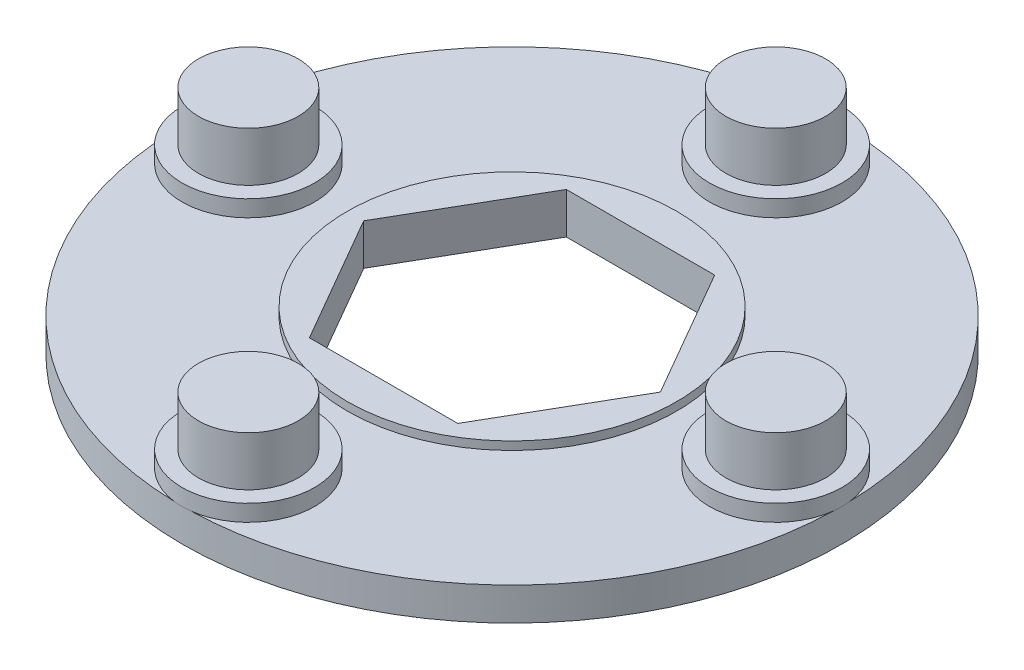
ISO-10303-21;
HEADER;
FILE_DESCRIPTION(('STEP AP214'),'2;1');
FILE_NAME('part.step','',(''),(''),'','','');
FILE_SCHEMA(('AUTOMOTIVE_DESIGN { 1 0 10303 214 1 1 1 1 }'));
ENDSEC;
DATA;
#1=APPLICATION_CONTEXT('core data for automotive mechanical design processes');
#2=APPLICATION_PROTOCOL_DEFINITION('international standard','automotive_design',2000,#1);
#3=PRODUCT_CONTEXT('',#1,'mechanical');
#4=PRODUCT('Part','Part','',(#3));
#5=PRODUCT_RELATED_PRODUCT_CATEGORY('part','',(#4));
#6=PRODUCT_DEFINITION_FORMATION('','',#4);
#7=PRODUCT_DEFINITION_CONTEXT('part definition',#1,'design');
#8=PRODUCT_DEFINITION('design','',#6,#7);
#9=PRODUCT_DEFINITION_SHAPE('','',#8);
#10=(LENGTH_UNIT() NAMED_UNIT(*) SI_UNIT(.MILLI.,.METRE.));
#11=(NAMED_UNIT(*) PLANE_ANGLE_UNIT() SI_UNIT($,.RADIAN.));
#12=(NAMED_UNIT(*) SI_UNIT($,.STERADIAN.) SOLID_ANGLE_UNIT());
#13=UNCERTAINTY_MEASURE_WITH_UNIT(LENGTH_MEASURE(1.E-05),#10,'distance_accuracy_value','');
#14=(GEOMETRIC_REPRESENTATION_CONTEXT(3) GLOBAL_UNCERTAINTY_ASSIGNED_CONTEXT((#13)) GLOBAL_UNIT_ASSIGNED_CONTEXT((#10,
#11,#12)) REPRESENTATION_CONTEXT('',''));
#15=CARTESIAN_POINT('',(0.,0.,0.));
#16=DIRECTION('',(0.,0.,1.));
#17=DIRECTION('',(1.,0.,0.));
#18=AXIS2_PLACEMENT_3D('',#15,#16,#17);
#19=CARTESIAN_POINT('',(0.,2.,0.));
#20=DIRECTION('',(0.,-1.,0.));
#21=DIRECTION('',(0.,0.,-1.));
#22=AXIS2_PLACEMENT_3D('',#19,#20,#21);
#23=CYLINDRICAL_SURFACE('',#22,20.);
#24=CARTESIAN_POINT('',(0.,2.,0.));
#25=DIRECTION('',(0.,1.,0.));
#26=DIRECTION('',(0.,0.,1.));
#27=AXIS2_PLACEMENT_3D('',#24,#25,#26);
#28=CIRCLE('',#27,20.);
#29=CARTESIAN_POINT('',(0.500741393313961,2.,-19.99373046875));
#30=VERTEX_POINT('',#29);
#31=CARTESIAN_POINT('',(-0.500741393313963,2.,-19.99373046875));
#32=VERTEX_POINT('',#31);
#33=EDGE_CURVE('E11',#30,#32,#28,.T.);
#34=ORIENTED_EDGE('',*,*,#33,.F.);
#35=CARTESIAN_POINT('',(19.99373046875,2.,-0.500741393313964));
#36=VERTEX_POINT('',#35);
#37=EDGE_CURVE('E131',#36,#30,#28,.T.);
#38=ORIENTED_EDGE('',*,*,#37,.F.);
#39=CARTESIAN_POINT('',(0.,2.,0.));
#40=DIRECTION('',(0.,1.,0.));
#41=DIRECTION('',(0.,0.,1.));
#42=AXIS2_PLACEMENT_3D('',#39,#40,#41);
#43=CIRCLE('',#42,20.);
#44=CARTESIAN_POINT('',(19.99373046875,2.,0.50074139331396));
#45=VERTEX_POINT('',#44);
#46=EDGE_CURVE('E151',#45,#36,#43,.T.);
#47=ORIENTED_EDGE('',*,*,#46,.F.);
#48=CARTESIAN_POINT('',(0.500741393313965,2.,19.99373046875));
#49=VERTEX_POINT('',#48);
#50=EDGE_CURVE('E132',#49,#45,#28,.T.);
#51=ORIENTED_EDGE('',*,*,#50,.F.);
#52=CARTESIAN_POINT('',(0.,2.,0.));
#53=DIRECTION('',(0.,1.,0.));
#54=DIRECTION('',(0.,0.,1.));
#55=AXIS2_PLACEMENT_3D('',#52,#53,#54);
#56=CIRCLE('',#55,20.);
#57=CARTESIAN_POINT('',(-0.500741393313959,2.,19.99373046875));
#58=VERTEX_POINT('',#57);
#59=EDGE_CURVE('E155',#58,#49,#56,.T.);
#60=ORIENTED_EDGE('',*,*,#59,.F.);
#61=CARTESIAN_POINT('',(-19.99373046875,2.,0.500741393313966));
#62=VERTEX_POINT('',#61);
#63=EDGE_CURVE('E42',#62,#58,#28,.T.);
#64=ORIENTED_EDGE('',*,*,#63,.F.);
#65=CARTESIAN_POINT('',(0.,2.,0.));
#66=DIRECTION('',(0.,1.,0.));
#67=DIRECTION('',(0.,0.,1.));
#68=AXIS2_PLACEMENT_3D('',#65,#66,#67);
#69=CIRCLE('',#68,20.);
#70=CARTESIAN_POINT('',(-19.99373046875,2.,-0.500741393313958));
#71=VERTEX_POINT('',#70);
#72=EDGE_CURVE('E119',#71,#62,#69,.T.);
#73=ORIENTED_EDGE('',*,*,#72,.F.);
#74=EDGE_CURVE('E40',#32,#71,#28,.T.);
#75=ORIENTED_EDGE('',*,*,#74,.F.);
#76=EDGE_LOOP('',(#34,#38,#47,#51,#60,#64,#73,#75));
#77=FACE_BOUND('',#76,.T.);
#78=CARTESIAN_POINT('',(0.,0.,0.));
#79=DIRECTION('',(0.,1.,0.));
#80=DIRECTION('',(0.,0.,1.));
#81=AXIS2_PLACEMENT_3D('',#78,#79,#80);
#82=CIRCLE('',#81,20.);
#83=CARTESIAN_POINT('',(0.,0.,20.));
#84=VERTEX_POINT('',#83);
#85=EDGE_CURVE('E135',#84,#84,#82,.T.);
#86=ORIENTED_EDGE('',*,*,#85,.T.);
#87=EDGE_LOOP('',(#86));
#88=FACE_BOUND('',#87,.T.);
#89=ADVANCED_FACE('F32',(#77,#88),#23,.T.);
#90=CARTESIAN_POINT('',(0.,2.,0.));
#91=DIRECTION('',(0.,1.,0.));
#92=DIRECTION('',(0.,0.,1.));
#93=AXIS2_PLACEMENT_3D('',#90,#91,#92);
#94=PLANE('',#93);
#95=CARTESIAN_POINT('',(0.,2.,0.));
#96=DIRECTION('',(0.,1.,0.));
#97=DIRECTION('',(0.,0.,1.));
#98=AXIS2_PLACEMENT_3D('',#95,#96,#97);
#99=CIRCLE('',#98,10.);
#100=CARTESIAN_POINT('',(0.,2.,10.));
#101=VERTEX_POINT('',#100);
#102=EDGE_CURVE('E226',#101,#101,#99,.T.);
#103=ORIENTED_EDGE('',*,*,#102,.F.);
#104=EDGE_LOOP('',(#103));
#105=FACE_BOUND('',#104,.T.);
#106=ORIENTED_EDGE('',*,*,#74,.T.);
#107=CARTESIAN_POINT('',(-16.,2.,0.));
#108=DIRECTION('',(0.,1.,0.));
#109=DIRECTION('',(0.,0.,1.));
#110=AXIS2_PLACEMENT_3D('',#107,#108,#109);
#111=CIRCLE('',#110,4.025);
#112=EDGE_CURVE('E110',#62,#71,#111,.T.);
#113=ORIENTED_EDGE('',*,*,#112,.F.);
#114=ORIENTED_EDGE('',*,*,#63,.T.);
#115=CARTESIAN_POINT('',(0.,2.,16.));
#116=DIRECTION('',(0.,1.,0.));
#117=DIRECTION('',(0.,0.,1.));
#118=AXIS2_PLACEMENT_3D('',#115,#116,#117);
#119=CIRCLE('',#118,4.025);
#120=EDGE_CURVE('E166',#49,#58,#119,.T.);
#121=ORIENTED_EDGE('',*,*,#120,.F.);
#122=ORIENTED_EDGE('',*,*,#50,.T.);
#123=CARTESIAN_POINT('',(16.,2.,0.));
#124=DIRECTION('',(0.,1.,0.));
#125=DIRECTION('',(0.,0.,1.));
#126=AXIS2_PLACEMENT_3D('',#123,#124,#125);
#127=CIRCLE('',#126,4.025);
#128=EDGE_CURVE('E154',#36,#45,#127,.T.);
#129=ORIENTED_EDGE('',*,*,#128,.F.);
#130=ORIENTED_EDGE('',*,*,#37,.T.);
#131=CARTESIAN_POINT('',(0.,2.,-16.));
#132=DIRECTION('',(0.,1.,0.));
#133=DIRECTION('',(0.,0.,1.));
#134=AXIS2_PLACEMENT_3D('',#131,#132,#133);
#135=CIRCLE('',#134,4.025);
#136=EDGE_CURVE('E130',#32,#30,#135,.T.);
#137=ORIENTED_EDGE('',*,*,#136,.F.);
#138=EDGE_LOOP('',(#106,#113,#114,#121,#122,#129,#130,#137));
#139=FACE_BOUND('',#138,.T.);
#140=ADVANCED_FACE('F128',(#105,#139),#94,.T.);
#141=CARTESIAN_POINT('',(0.,0.,0.));
#142=DIRECTION('',(0.,1.,0.));
#143=DIRECTION('',(0.,0.,1.));
#144=AXIS2_PLACEMENT_3D('',#141,#142,#143);
#145=PLANE('',#144);
#146=DIRECTION('',(0.5,0.,0.866025403784439));
#147=VECTOR('',#146,1.);
#148=CARTESIAN_POINT('',(-6.75,0.,3.89711431702997));
#149=LINE('',#148,#147);
#150=CARTESIAN_POINT('',(-8.99999999999999,0.,0.));
#151=VERTEX_POINT('',#150);
#152=CARTESIAN_POINT('',(-4.5,0.,7.79422863405995));
#153=VERTEX_POINT('',#152);
#154=EDGE_CURVE('E220',#151,#153,#149,.T.);
#155=ORIENTED_EDGE('',*,*,#154,.T.);
#156=DIRECTION('',(1.,0.,0.));
#157=VECTOR('',#156,1.);
#158=CARTESIAN_POINT('',(0.,0.,7.79422863405995));
#159=LINE('',#158,#157);
#160=CARTESIAN_POINT('',(4.5,0.,7.79422863405995));
#161=VERTEX_POINT('',#160);
#162=EDGE_CURVE('E223',#153,#161,#159,.T.);
#163=ORIENTED_EDGE('',*,*,#162,.T.);
#164=DIRECTION('',(0.5,0.,-0.866025403784439));
#165=VECTOR('',#164,1.);
#166=CARTESIAN_POINT('',(6.75,0.,3.89711431702997));
#167=LINE('',#166,#165);
#168=CARTESIAN_POINT('',(9.,0.,0.));
#169=VERTEX_POINT('',#168);
#170=EDGE_CURVE('E198',#161,#169,#167,.T.);
#171=ORIENTED_EDGE('',*,*,#170,.T.);
#172=DIRECTION('',(-0.5,0.,-0.866025403784439));
#173=VECTOR('',#172,1.);
#174=CARTESIAN_POINT('',(6.75,0.,-3.89711431702997));
#175=LINE('',#174,#173);
#176=CARTESIAN_POINT('',(4.5,0.,-7.79422863405995));
#177=VERTEX_POINT('',#176);
#178=EDGE_CURVE('E211',#169,#177,#175,.T.);
#179=ORIENTED_EDGE('',*,*,#178,.T.);
#180=DIRECTION('',(-1.,0.,0.));
#181=VECTOR('',#180,1.);
#182=CARTESIAN_POINT('',(0.,0.,-7.79422863405995));
#183=LINE('',#182,#181);
#184=CARTESIAN_POINT('',(-4.5,0.,-7.79422863405995));
#185=VERTEX_POINT('',#184);
#186=EDGE_CURVE('E214',#177,#185,#183,.T.);
#187=ORIENTED_EDGE('',*,*,#186,.T.);
#188=DIRECTION('',(-0.5,0.,0.866025403784439));
#189=VECTOR('',#188,1.);
#190=CARTESIAN_POINT('',(-6.75,0.,-3.89711431702997));
#191=LINE('',#190,#189);
#192=EDGE_CURVE('E217',#185,#151,#191,.T.);
#193=ORIENTED_EDGE('',*,*,#192,.T.);
#194=EDGE_LOOP('',(#155,#163,#171,#179,#187,#193));
#195=FACE_BOUND('',#194,.T.);
#196=ORIENTED_EDGE('',*,*,#85,.F.);
#197=EDGE_LOOP('',(#196));
#198=FACE_BOUND('',#197,.T.);
#199=ADVANCED_FACE('F262',(#195,#198),#145,.F.);
#200=CARTESIAN_POINT('',(0.,2.5,0.));
#201=DIRECTION('',(0.,-1.,0.));
#202=DIRECTION('',(0.,0.,-1.));
#203=AXIS2_PLACEMENT_3D('',#200,#201,#202);
#204=CYLINDRICAL_SURFACE('',#203,10.);
#205=CARTESIAN_POINT('',(0.,2.5,0.));
#206=DIRECTION('',(0.,1.,0.));
#207=DIRECTION('',(0.,0.,1.));
#208=AXIS2_PLACEMENT_3D('',#205,#206,#207);
#209=CIRCLE('',#208,10.);
#210=CARTESIAN_POINT('',(0.,2.5,10.));
#211=VERTEX_POINT('',#210);
#212=EDGE_CURVE('E227',#211,#211,#209,.T.);
#213=ORIENTED_EDGE('',*,*,#212,.F.);
#214=EDGE_LOOP('',(#213));
#215=FACE_BOUND('',#214,.T.);
#216=ORIENTED_EDGE('',*,*,#102,.T.);
#217=EDGE_LOOP('',(#216));
#218=FACE_BOUND('',#217,.T.);
#219=ADVANCED_FACE('F268',(#215,#218),#204,.T.);
#220=CARTESIAN_POINT('',(0.,2.5,0.));
#221=DIRECTION('',(0.,1.,0.));
#222=DIRECTION('',(0.,0.,1.));
#223=AXIS2_PLACEMENT_3D('',#220,#221,#222);
#224=PLANE('',#223);
#225=DIRECTION('',(1.,0.,0.));
#226=VECTOR('',#225,1.);
#227=CARTESIAN_POINT('',(-4.5,2.5,7.79422863405995));
#228=LINE('',#227,#226);
#229=CARTESIAN_POINT('',(-4.5,2.5,7.79422863405995));
#230=VERTEX_POINT('',#229);
#231=CARTESIAN_POINT('',(4.5,2.5,7.79422863405995));
#232=VERTEX_POINT('',#231);
#233=EDGE_CURVE('E147',#230,#232,#228,.T.);
#234=ORIENTED_EDGE('',*,*,#233,.F.);
#235=DIRECTION('',(0.5,0.,0.866025403784439));
#236=VECTOR('',#235,1.);
#237=CARTESIAN_POINT('',(-8.99999999999999,2.5,0.));
#238=LINE('',#237,#236);
#239=CARTESIAN_POINT('',(-8.99999999999999,2.5,0.));
#240=VERTEX_POINT('',#239);
#241=EDGE_CURVE('E192',#240,#230,#238,.T.);
#242=ORIENTED_EDGE('',*,*,#241,.F.);
#243=DIRECTION('',(-0.5,0.,0.866025403784439));
#244=VECTOR('',#243,1.);
#245=CARTESIAN_POINT('',(-4.5,2.5,-7.79422863405995));
#246=LINE('',#245,#244);
#247=CARTESIAN_POINT('',(-4.5,2.5,-7.79422863405995));
#248=VERTEX_POINT('',#247);
#249=EDGE_CURVE('E189',#248,#240,#246,.T.);
#250=ORIENTED_EDGE('',*,*,#249,.F.);
#251=DIRECTION('',(-1.,0.,0.));
#252=VECTOR('',#251,1.);
#253=CARTESIAN_POINT('',(4.5,2.5,-7.79422863405995));
#254=LINE('',#253,#252);
#255=CARTESIAN_POINT('',(4.5,2.5,-7.79422863405995));
#256=VERTEX_POINT('',#255);
#257=EDGE_CURVE('E186',#256,#248,#254,.T.);
#258=ORIENTED_EDGE('',*,*,#257,.F.);
#259=DIRECTION('',(-0.5,0.,-0.866025403784439));
#260=VECTOR('',#259,1.);
#261=CARTESIAN_POINT('',(9.,2.5,0.));
#262=LINE('',#261,#260);
#263=CARTESIAN_POINT('',(9.,2.5,0.));
#264=VERTEX_POINT('',#263);
#265=EDGE_CURVE('E183',#264,#256,#262,.T.);
#266=ORIENTED_EDGE('',*,*,#265,.F.);
#267=DIRECTION('',(0.5,0.,-0.866025403784439));
#268=VECTOR('',#267,1.);
#269=CARTESIAN_POINT('',(4.5,2.5,7.79422863405995));
#270=LINE('',#269,#268);
#271=EDGE_CURVE('E180',#232,#264,#270,.T.);
#272=ORIENTED_EDGE('',*,*,#271,.F.);
#273=EDGE_LOOP('',(#234,#242,#250,#258,#266,#272));
#274=FACE_BOUND('',#273,.T.);
#275=ORIENTED_EDGE('',*,*,#212,.T.);
#276=EDGE_LOOP('',(#275));
#277=FACE_BOUND('',#276,.T.);
#278=ADVANCED_FACE('F323',(#274,#277),#224,.T.);
#279=CARTESIAN_POINT('',(-4.5,-3.5,7.79422863405995));
#280=DIRECTION('',(0.,0.,1.));
#281=DIRECTION('',(1.,0.,0.));
#282=AXIS2_PLACEMENT_3D('',#279,#280,#281);
#283=PLANE('',#282);
#284=DIRECTION('',(0.,1.,0.));
#285=VECTOR('',#284,1.);
#286=CARTESIAN_POINT('',(-4.5,-3.5,7.79422863405995));
#287=LINE('',#286,#285);
#288=EDGE_CURVE('E196',#153,#230,#287,.T.);
#289=ORIENTED_EDGE('',*,*,#288,.T.);
#290=ORIENTED_EDGE('',*,*,#233,.T.);
#291=DIRECTION('',(0.,1.,0.));
#292=VECTOR('',#291,1.);
#293=CARTESIAN_POINT('',(4.5,-3.5,7.79422863405995));
#294=LINE('',#293,#292);
#295=EDGE_CURVE('E195',#161,#232,#294,.T.);
#296=ORIENTED_EDGE('',*,*,#295,.F.);
#297=ORIENTED_EDGE('',*,*,#162,.F.);
#298=EDGE_LOOP('',(#289,#290,#296,#297));
#299=FACE_BOUND('',#298,.T.);
#300=ADVANCED_FACE('F305',(#299),#283,.F.);
#301=CARTESIAN_POINT('',(-8.99999999999999,-3.5,0.));
#302=DIRECTION('',(-0.866025403784439,0.,0.5));
#303=DIRECTION('',(0.5,0.,0.866025403784439));
#304=AXIS2_PLACEMENT_3D('',#301,#302,#303);
#305=PLANE('',#304);
#306=DIRECTION('',(0.,1.,0.));
#307=VECTOR('',#306,1.);
#308=CARTESIAN_POINT('',(-8.99999999999999,-3.5,0.));
#309=LINE('',#308,#307);
#310=EDGE_CURVE('E199',#151,#240,#309,.T.);
#311=ORIENTED_EDGE('',*,*,#310,.T.);
#312=ORIENTED_EDGE('',*,*,#241,.T.);
#313=ORIENTED_EDGE('',*,*,#288,.F.);
#314=ORIENTED_EDGE('',*,*,#154,.F.);
#315=EDGE_LOOP('',(#311,#312,#313,#314));
#316=FACE_BOUND('',#315,.T.);
#317=ADVANCED_FACE('F301',(#316),#305,.F.);
#318=CARTESIAN_POINT('',(-4.5,-3.5,-7.79422863405995));
#319=DIRECTION('',(-0.866025403784439,0.,-0.5));
#320=DIRECTION('',(-0.5,0.,0.866025403784439));
#321=AXIS2_PLACEMENT_3D('',#318,#319,#320);
#322=PLANE('',#321);
#323=DIRECTION('',(0.,1.,0.));
#324=VECTOR('',#323,1.);
#325=CARTESIAN_POINT('',(-4.5,-3.5,-7.79422863405995));
#326=LINE('',#325,#324);
#327=EDGE_CURVE('E201',#185,#248,#326,.T.);
#328=ORIENTED_EDGE('',*,*,#327,.T.);
#329=ORIENTED_EDGE('',*,*,#249,.T.);
#330=ORIENTED_EDGE('',*,*,#310,.F.);
#331=ORIENTED_EDGE('',*,*,#192,.F.);
#332=EDGE_LOOP('',(#328,#329,#330,#331));
#333=FACE_BOUND('',#332,.T.);
#334=ADVANCED_FACE('F304',(#333),#322,.F.);
#335=CARTESIAN_POINT('',(4.5,-3.5,-7.79422863405995));
#336=DIRECTION('',(0.,0.,-1.));
#337=DIRECTION('',(-1.,0.,0.));
#338=AXIS2_PLACEMENT_3D('',#335,#336,#337);
#339=PLANE('',#338);
#340=DIRECTION('',(0.,1.,0.));
#341=VECTOR('',#340,1.);
#342=CARTESIAN_POINT('',(4.5,-3.5,-7.79422863405995));
#343=LINE('',#342,#341);
#344=EDGE_CURVE('E203',#177,#256,#343,.T.);
#345=ORIENTED_EDGE('',*,*,#344,.T.);
#346=ORIENTED_EDGE('',*,*,#257,.T.);
#347=ORIENTED_EDGE('',*,*,#327,.F.);
#348=ORIENTED_EDGE('',*,*,#186,.F.);
#349=EDGE_LOOP('',(#345,#346,#347,#348));
#350=FACE_BOUND('',#349,.T.);
#351=ADVANCED_FACE('F309',(#350),#339,.F.);
#352=CARTESIAN_POINT('',(9.,-3.5,0.));
#353=DIRECTION('',(0.866025403784439,0.,-0.5));
#354=DIRECTION('',(-0.5,0.,-0.866025403784439));
#355=AXIS2_PLACEMENT_3D('',#352,#353,#354);
#356=PLANE('',#355);
#357=DIRECTION('',(0.,1.,0.));
#358=VECTOR('',#357,1.);
#359=CARTESIAN_POINT('',(9.,-3.5,0.));
#360=LINE('',#359,#358);
#361=EDGE_CURVE('E205',#169,#264,#360,.T.);
#362=ORIENTED_EDGE('',*,*,#361,.T.);
#363=ORIENTED_EDGE('',*,*,#265,.T.);
#364=ORIENTED_EDGE('',*,*,#344,.F.);
#365=ORIENTED_EDGE('',*,*,#178,.F.);
#366=EDGE_LOOP('',(#362,#363,#364,#365));
#367=FACE_BOUND('',#366,.T.);
#368=ADVANCED_FACE('F313',(#367),#356,.F.);
#369=CARTESIAN_POINT('',(4.5,-3.5,7.79422863405995));
#370=DIRECTION('',(0.866025403784439,0.,0.5));
#371=DIRECTION('',(0.5,0.,-0.866025403784439));
#372=AXIS2_PLACEMENT_3D('',#369,#370,#371);
#373=PLANE('',#372);
#374=ORIENTED_EDGE('',*,*,#295,.T.);
#375=ORIENTED_EDGE('',*,*,#271,.T.);
#376=ORIENTED_EDGE('',*,*,#361,.F.);
#377=ORIENTED_EDGE('',*,*,#170,.F.);
#378=EDGE_LOOP('',(#374,#375,#376,#377));
#379=FACE_BOUND('',#378,.T.);
#380=ADVANCED_FACE('F299',(#379),#373,.F.);
#381=CARTESIAN_POINT('',(0.,3.,-16.));
#382=DIRECTION('',(0.,-1.,0.));
#383=DIRECTION('',(0.,0.,-1.));
#384=AXIS2_PLACEMENT_3D('',#381,#382,#383);
#385=CYLINDRICAL_SURFACE('',#384,4.025);
#386=CARTESIAN_POINT('',(0.,3.,-16.));
#387=DIRECTION('',(0.,1.,0.));
#388=DIRECTION('',(0.,0.,1.));
#389=AXIS2_PLACEMENT_3D('',#386,#387,#388);
#390=CIRCLE('',#389,4.025);
#391=CARTESIAN_POINT('',(0.,3.,-11.975));
#392=VERTEX_POINT('',#391);
#393=EDGE_CURVE('E148',#392,#392,#390,.T.);
#394=ORIENTED_EDGE('',*,*,#393,.F.);
#395=EDGE_LOOP('',(#394));
#396=FACE_BOUND('',#395,.T.);
#397=EDGE_CURVE('E177',#30,#32,#135,.T.);
#398=ORIENTED_EDGE('',*,*,#397,.T.);
#399=ORIENTED_EDGE('',*,*,#136,.T.);
#400=EDGE_LOOP('',(#398,#399));
#401=FACE_BOUND('',#400,.T.);
#402=ADVANCED_FACE('F291',(#396,#401),#385,.T.);
#403=CARTESIAN_POINT('',(0.,3.,-16.));
#404=DIRECTION('',(0.,1.,0.));
#405=DIRECTION('',(0.,0.,1.));
#406=AXIS2_PLACEMENT_3D('',#403,#404,#405);
#407=PLANE('',#406);
#408=CARTESIAN_POINT('',(0.,3.,-16.));
#409=DIRECTION('',(0.,1.,0.));
#410=DIRECTION('',(0.,0.,1.));
#411=AXIS2_PLACEMENT_3D('',#408,#409,#410);
#412=CIRCLE('',#411,3.025);
#413=CARTESIAN_POINT('',(0.,3.,-12.975));
#414=VERTEX_POINT('',#413);
#415=EDGE_CURVE('E144',#414,#414,#412,.T.);
#416=ORIENTED_EDGE('',*,*,#415,.F.);
#417=EDGE_LOOP('',(#416));
#418=FACE_BOUND('',#417,.T.);
#419=ORIENTED_EDGE('',*,*,#393,.T.);
#420=EDGE_LOOP('',(#419));
#421=FACE_BOUND('',#420,.T.);
#422=ADVANCED_FACE('F283',(#418,#421),#407,.T.);
#423=CARTESIAN_POINT('',(0.,2.,-16.));
#424=DIRECTION('',(0.,1.,0.));
#425=DIRECTION('',(0.,0.,1.));
#426=AXIS2_PLACEMENT_3D('',#423,#424,#425);
#427=PLANE('',#426);
#428=ORIENTED_EDGE('',*,*,#397,.F.);
#429=ORIENTED_EDGE('',*,*,#33,.T.);
#430=EDGE_LOOP('',(#428,#429));
#431=FACE_BOUND('',#430,.T.);
#432=ADVANCED_FACE('F278',(#431),#427,.F.);
#433=CARTESIAN_POINT('',(0.,6.,-16.));
#434=DIRECTION('',(0.,1.,0.));
#435=DIRECTION('',(0.,0.,1.));
#436=AXIS2_PLACEMENT_3D('',#433,#434,#435);
#437=PLANE('',#436);
#438=CARTESIAN_POINT('',(0.,6.,-16.));
#439=DIRECTION('',(0.,1.,0.));
#440=DIRECTION('',(0.,0.,1.));
#441=AXIS2_PLACEMENT_3D('',#438,#439,#440);
#442=CIRCLE('',#441,3.025);
#443=CARTESIAN_POINT('',(0.,6.,-12.975));
#444=VERTEX_POINT('',#443);
#445=EDGE_CURVE('E139',#444,#444,#442,.T.);
#446=ORIENTED_EDGE('',*,*,#445,.T.);
#447=EDGE_LOOP('',(#446));
#448=FACE_BOUND('',#447,.T.);
#449=ADVANCED_FACE('F275',(#448),#437,.T.);
#450=CARTESIAN_POINT('',(0.,6.,-16.));
#451=DIRECTION('',(0.,-1.,0.));
#452=DIRECTION('',(0.,0.,-1.));
#453=AXIS2_PLACEMENT_3D('',#450,#451,#452);
#454=CYLINDRICAL_SURFACE('',#453,3.025);
#455=ORIENTED_EDGE('',*,*,#415,.T.);
#456=EDGE_LOOP('',(#455));
#457=FACE_BOUND('',#456,.T.);
#458=ORIENTED_EDGE('',*,*,#445,.F.);
#459=EDGE_LOOP('',(#458));
#460=FACE_BOUND('',#459,.T.);
#461=ADVANCED_FACE('F272',(#457,#460),#454,.T.);
#462=CARTESIAN_POINT('',(16.,3.,0.));
#463=DIRECTION('',(0.,-1.,0.));
#464=DIRECTION('',(0.,0.,-1.));
#465=AXIS2_PLACEMENT_3D('',#462,#463,#464);
#466=CYLINDRICAL_SURFACE('',#465,4.025);
#467=CARTESIAN_POINT('',(16.,3.,0.));
#468=DIRECTION('',(0.,1.,0.));
#469=DIRECTION('',(0.,0.,1.));
#470=AXIS2_PLACEMENT_3D('',#467,#468,#469);
#471=CIRCLE('',#470,4.025);
#472=CARTESIAN_POINT('',(16.,3.,4.025));
#473=VERTEX_POINT('',#472);
#474=EDGE_CURVE('E170',#473,#473,#471,.T.);
#475=ORIENTED_EDGE('',*,*,#474,.F.);
#476=EDGE_LOOP('',(#475));
#477=FACE_BOUND('',#476,.T.);
#478=EDGE_CURVE('E159',#45,#36,#127,.T.);
#479=ORIENTED_EDGE('',*,*,#478,.T.);
#480=ORIENTED_EDGE('',*,*,#128,.T.);
#481=EDGE_LOOP('',(#479,#480));
#482=FACE_BOUND('',#481,.T.);
#483=ADVANCED_FACE('F274',(#477,#482),#466,.T.);
#484=CARTESIAN_POINT('',(16.,3.,0.));
#485=DIRECTION('',(0.,1.,0.));
#486=DIRECTION('',(0.,0.,1.));
#487=AXIS2_PLACEMENT_3D('',#484,#485,#486);
#488=PLANE('',#487);
#489=CARTESIAN_POINT('',(16.0000000000011,3.,-1.06403836578139E-12));
#490=DIRECTION('',(0.,1.,0.));
#491=DIRECTION('',(0.,0.,1.));
#492=AXIS2_PLACEMENT_3D('',#489,#490,#491);
#493=CIRCLE('',#492,3.025);
#494=CARTESIAN_POINT('',(16.0000000000011,3.,3.02499999999894));
#495=VERTEX_POINT('',#494);
#496=EDGE_CURVE('E149',#495,#495,#493,.T.);
#497=ORIENTED_EDGE('',*,*,#496,.F.);
#498=EDGE_LOOP('',(#497));
#499=FACE_BOUND('',#498,.T.);
#500=ORIENTED_EDGE('',*,*,#474,.T.);
#501=EDGE_LOOP('',(#500));
#502=FACE_BOUND('',#501,.T.);
#503=ADVANCED_FACE('F367',(#499,#502),#488,.T.);
#504=CARTESIAN_POINT('',(16.,2.,0.));
#505=DIRECTION('',(0.,1.,0.));
#506=DIRECTION('',(0.,0.,1.));
#507=AXIS2_PLACEMENT_3D('',#504,#505,#506);
#508=PLANE('',#507);
#509=ORIENTED_EDGE('',*,*,#478,.F.);
#510=ORIENTED_EDGE('',*,*,#46,.T.);
#511=EDGE_LOOP('',(#509,#510));
#512=FACE_BOUND('',#511,.T.);
#513=ADVANCED_FACE('F255',(#512),#508,.F.);
#514=CARTESIAN_POINT('',(16.0000000000011,6.,-1.06403836578139E-12));
#515=DIRECTION('',(0.,1.,0.));
#516=DIRECTION('',(0.,0.,1.));
#517=AXIS2_PLACEMENT_3D('',#514,#515,#516);
#518=PLANE('',#517);
#519=CARTESIAN_POINT('',(16.0000000000011,6.,-1.06403836578139E-12));
#520=DIRECTION('',(0.,1.,0.));
#521=DIRECTION('',(0.,0.,1.));
#522=AXIS2_PLACEMENT_3D('',#519,#520,#521);
#523=CIRCLE('',#522,3.025);
#524=CARTESIAN_POINT('',(16.0000000000011,6.,3.02499999999894));
#525=VERTEX_POINT('',#524);
#526=EDGE_CURVE('E142',#525,#525,#523,.T.);
#527=ORIENTED_EDGE('',*,*,#526,.T.);
#528=EDGE_LOOP('',(#527));
#529=FACE_BOUND('',#528,.T.);
#530=ADVANCED_FACE('F241',(#529),#518,.T.);
#531=CARTESIAN_POINT('',(16.0000000000011,6.,-1.06403836578139E-12));
#532=DIRECTION('',(0.,-1.,0.));
#533=DIRECTION('',(0.,0.,-1.));
#534=AXIS2_PLACEMENT_3D('',#531,#532,#533);
#535=CYLINDRICAL_SURFACE('',#534,3.025);
#536=ORIENTED_EDGE('',*,*,#496,.T.);
#537=EDGE_LOOP('',(#536));
#538=FACE_BOUND('',#537,.T.);
#539=ORIENTED_EDGE('',*,*,#526,.F.);
#540=EDGE_LOOP('',(#539));
#541=FACE_BOUND('',#540,.T.);
#542=ADVANCED_FACE('F243',(#538,#541),#535,.T.);
#543=CARTESIAN_POINT('',(0.,3.,16.));
#544=DIRECTION('',(0.,-1.,0.));
#545=DIRECTION('',(0.,0.,-1.));
#546=AXIS2_PLACEMENT_3D('',#543,#544,#545);
#547=CYLINDRICAL_SURFACE('',#546,4.025);
#548=CARTESIAN_POINT('',(0.,3.,16.));
#549=DIRECTION('',(0.,1.,0.));
#550=DIRECTION('',(0.,0.,1.));
#551=AXIS2_PLACEMENT_3D('',#548,#549,#550);
#552=CIRCLE('',#551,4.025);
#553=CARTESIAN_POINT('',(0.,3.,20.025));
#554=VERTEX_POINT('',#553);
#555=EDGE_CURVE('E161',#554,#554,#552,.T.);
#556=ORIENTED_EDGE('',*,*,#555,.F.);
#557=EDGE_LOOP('',(#556));
#558=FACE_BOUND('',#557,.T.);
#559=ORIENTED_EDGE('',*,*,#120,.T.);
#560=EDGE_CURVE('E55',#58,#49,#119,.T.);
#561=ORIENTED_EDGE('',*,*,#560,.T.);
#562=EDGE_LOOP('',(#559,#561));
#563=FACE_BOUND('',#562,.T.);
#564=ADVANCED_FACE('F245',(#558,#563),#547,.T.);
#565=CARTESIAN_POINT('',(0.,3.,16.));
#566=DIRECTION('',(0.,1.,0.));
#567=DIRECTION('',(0.,0.,1.));
#568=AXIS2_PLACEMENT_3D('',#565,#566,#567);
#569=PLANE('',#568);
#570=CARTESIAN_POINT('',(2.12807673156277E-12,3.,16.));
#571=DIRECTION('',(0.,1.,0.));
#572=DIRECTION('',(0.,0.,1.));
#573=AXIS2_PLACEMENT_3D('',#570,#571,#572);
#574=CIRCLE('',#573,3.025);
#575=CARTESIAN_POINT('',(2.12807673156277E-12,3.,19.025));
#576=VERTEX_POINT('',#575);
#577=EDGE_CURVE('E152',#576,#576,#574,.T.);
#578=ORIENTED_EDGE('',*,*,#577,.F.);
#579=EDGE_LOOP('',(#578));
#580=FACE_BOUND('',#579,.T.);
#581=ORIENTED_EDGE('',*,*,#555,.T.);
#582=EDGE_LOOP('',(#581));
#583=FACE_BOUND('',#582,.T.);
#584=ADVANCED_FACE('F252',(#580,#583),#569,.T.);
#585=CARTESIAN_POINT('',(0.,2.,16.));
#586=DIRECTION('',(0.,1.,0.));
#587=DIRECTION('',(0.,0.,1.));
#588=AXIS2_PLACEMENT_3D('',#585,#586,#587);
#589=PLANE('',#588);
#590=ORIENTED_EDGE('',*,*,#560,.F.);
#591=ORIENTED_EDGE('',*,*,#59,.T.);
#592=EDGE_LOOP('',(#590,#591));
#593=FACE_BOUND('',#592,.T.);
#594=ADVANCED_FACE('F343',(#593),#589,.F.);
#595=CARTESIAN_POINT('',(2.12807673156277E-12,6.,16.));
#596=DIRECTION('',(0.,1.,0.));
#597=DIRECTION('',(0.,0.,1.));
#598=AXIS2_PLACEMENT_3D('',#595,#596,#597);
#599=PLANE('',#598);
#600=CARTESIAN_POINT('',(2.12807673156277E-12,6.,16.));
#601=DIRECTION('',(0.,1.,0.));
#602=DIRECTION('',(0.,0.,1.));
#603=AXIS2_PLACEMENT_3D('',#600,#601,#602);
#604=CIRCLE('',#603,3.025);
#605=CARTESIAN_POINT('',(2.12807673156277E-12,6.,19.025));
#606=VERTEX_POINT('',#605);
#607=EDGE_CURVE('E235',#606,#606,#604,.T.);
#608=ORIENTED_EDGE('',*,*,#607,.T.);
#609=EDGE_LOOP('',(#608));
#610=FACE_BOUND('',#609,.T.);
#611=ADVANCED_FACE('F339',(#610),#599,.T.);
#612=CARTESIAN_POINT('',(2.12807673156277E-12,6.,16.));
#613=DIRECTION('',(0.,-1.,0.));
#614=DIRECTION('',(0.,0.,-1.));
#615=AXIS2_PLACEMENT_3D('',#612,#613,#614);
#616=CYLINDRICAL_SURFACE('',#615,3.025);
#617=ORIENTED_EDGE('',*,*,#577,.T.);
#618=EDGE_LOOP('',(#617));
#619=FACE_BOUND('',#618,.T.);
#620=ORIENTED_EDGE('',*,*,#607,.F.);
#621=EDGE_LOOP('',(#620));
#622=FACE_BOUND('',#621,.T.);
#623=ADVANCED_FACE('F342',(#619,#622),#616,.T.);
#624=CARTESIAN_POINT('',(-16.,3.,0.));
#625=DIRECTION('',(0.,-1.,0.));
#626=DIRECTION('',(0.,0.,-1.));
#627=AXIS2_PLACEMENT_3D('',#624,#625,#626);
#628=CYLINDRICAL_SURFACE('',#627,4.025);
#629=CARTESIAN_POINT('',(-16.,3.,0.));
#630=DIRECTION('',(0.,1.,0.));
#631=DIRECTION('',(0.,0.,1.));
#632=AXIS2_PLACEMENT_3D('',#629,#630,#631);
#633=CIRCLE('',#632,4.025);
#634=CARTESIAN_POINT('',(-16.,3.,4.025));
#635=VERTEX_POINT('',#634);
#636=EDGE_CURVE('E120',#635,#635,#633,.T.);
#637=ORIENTED_EDGE('',*,*,#636,.F.);
#638=EDGE_LOOP('',(#637));
#639=FACE_BOUND('',#638,.T.);
#640=EDGE_CURVE('E48',#71,#62,#111,.T.);
#641=ORIENTED_EDGE('',*,*,#640,.T.);
#642=ORIENTED_EDGE('',*,*,#112,.T.);
#643=EDGE_LOOP('',(#641,#642));
#644=FACE_BOUND('',#643,.T.);
#645=ADVANCED_FACE('F111',(#639,#644),#628,.T.);
#646=CARTESIAN_POINT('',(-16.,3.,0.));
#647=DIRECTION('',(0.,1.,0.));
#648=DIRECTION('',(0.,0.,1.));
#649=AXIS2_PLACEMENT_3D('',#646,#647,#648);
#650=PLANE('',#649);
#651=CARTESIAN_POINT('',(-15.9999999999989,3.,1.06599780066002E-12));
#652=DIRECTION('',(0.,1.,0.));
#653=DIRECTION('',(0.,0.,1.));
#654=AXIS2_PLACEMENT_3D('',#651,#652,#653);
#655=CIRCLE('',#654,3.025);
#656=CARTESIAN_POINT('',(-15.9999999999989,3.,3.02500000000107));
#657=VERTEX_POINT('',#656);
#658=EDGE_CURVE('E35',#657,#657,#655,.T.);
#659=ORIENTED_EDGE('',*,*,#658,.F.);
#660=EDGE_LOOP('',(#659));
#661=FACE_BOUND('',#660,.T.);
#662=ORIENTED_EDGE('',*,*,#636,.T.);
#663=EDGE_LOOP('',(#662));
#664=FACE_BOUND('',#663,.T.);
#665=ADVANCED_FACE('F349',(#661,#664),#650,.T.);
#666=CARTESIAN_POINT('',(-16.,2.,0.));
#667=DIRECTION('',(0.,1.,0.));
#668=DIRECTION('',(0.,0.,1.));
#669=AXIS2_PLACEMENT_3D('',#666,#667,#668);
#670=PLANE('',#669);
#671=ORIENTED_EDGE('',*,*,#640,.F.);
#672=ORIENTED_EDGE('',*,*,#72,.T.);
#673=EDGE_LOOP('',(#671,#672));
#674=FACE_BOUND('',#673,.T.);
#675=ADVANCED_FACE('F118',(#674),#670,.F.);
#676=CARTESIAN_POINT('',(-15.9999999999989,6.,1.06599780066002E-12));
#677=DIRECTION('',(0.,1.,0.));
#678=DIRECTION('',(0.,0.,1.));
#679=AXIS2_PLACEMENT_3D('',#676,#677,#678);
#680=PLANE('',#679);
#681=CARTESIAN_POINT('',(-15.9999999999989,6.,1.06599780066002E-12));
#682=DIRECTION('',(0.,1.,0.));
#683=DIRECTION('',(0.,0.,1.));
#684=AXIS2_PLACEMENT_3D('',#681,#682,#683);
#685=CIRCLE('',#684,3.025);
#686=CARTESIAN_POINT('',(-15.9999999999989,6.,3.02500000000107));
#687=VERTEX_POINT('',#686);
#688=EDGE_CURVE('E230',#687,#687,#685,.T.);
#689=ORIENTED_EDGE('',*,*,#688,.T.);
#690=EDGE_LOOP('',(#689));
#691=FACE_BOUND('',#690,.T.);
#692=ADVANCED_FACE('F331',(#691),#680,.T.);
#693=CARTESIAN_POINT('',(-15.9999999999989,6.,1.06599780066002E-12));
#694=DIRECTION('',(0.,-1.,0.));
#695=DIRECTION('',(0.,0.,-1.));
#696=AXIS2_PLACEMENT_3D('',#693,#694,#695);
#697=CYLINDRICAL_SURFACE('',#696,3.025);
#698=ORIENTED_EDGE('',*,*,#658,.T.);
#699=EDGE_LOOP('',(#698));
#700=FACE_BOUND('',#699,.T.);
#701=ORIENTED_EDGE('',*,*,#688,.F.);
#702=EDGE_LOOP('',(#701));
#703=FACE_BOUND('',#702,.T.);
#704=ADVANCED_FACE('F334',(#700,#703),#697,.T.);
#705=CLOSED_SHELL('',(#89,#140,#199,#219,#278,#300,#317,#334,#351,#368,#380,#402,#422,#432,#449,
#461,#483,#503,#513,#530,#542,#564,#584,#594,#611,#623,#645,#665,#675,#692,#704));
#706=MANIFOLD_SOLID_BREP('B2',#705);
#707=ADVANCED_BREP_SHAPE_REPRESENTATION('',(#18,#706),#14);
#708=SHAPE_DEFINITION_REPRESENTATION(#9,#707);
ENDSEC;
END-ISO-10303-21;
